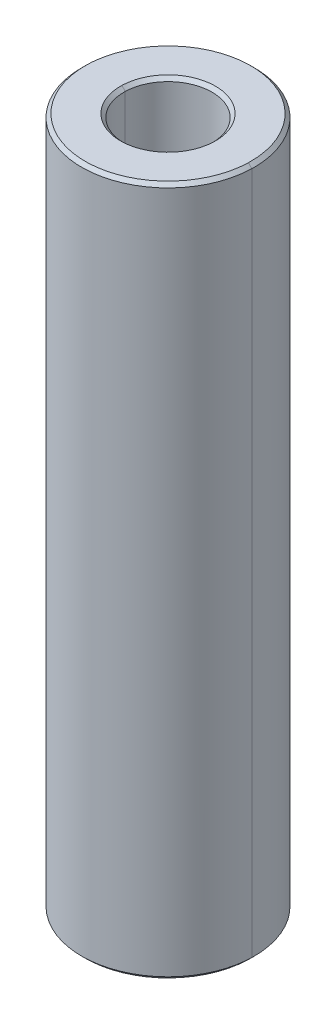
ISO-10303-21;
HEADER;
FILE_DESCRIPTION(('STEP AP214'),'2;1');
FILE_NAME('part.step','',(''),(''),'','','');
FILE_SCHEMA(('AUTOMOTIVE_DESIGN { 1 0 10303 214 1 1 1 1 }'));
ENDSEC;
DATA;
#1=APPLICATION_CONTEXT('core data for automotive mechanical design processes');
#2=APPLICATION_PROTOCOL_DEFINITION('international standard','automotive_design',2000,#1);
#3=PRODUCT_CONTEXT('',#1,'mechanical');
#4=PRODUCT('Part','Part','',(#3));
#5=PRODUCT_RELATED_PRODUCT_CATEGORY('part','',(#4));
#6=PRODUCT_DEFINITION_FORMATION('','',#4);
#7=PRODUCT_DEFINITION_CONTEXT('part definition',#1,'design');
#8=PRODUCT_DEFINITION('design','',#6,#7);
#9=PRODUCT_DEFINITION_SHAPE('','',#8);
#10=(LENGTH_UNIT() NAMED_UNIT(*) SI_UNIT(.MILLI.,.METRE.));
#11=(NAMED_UNIT(*) PLANE_ANGLE_UNIT() SI_UNIT($,.RADIAN.));
#12=(NAMED_UNIT(*) SI_UNIT($,.STERADIAN.) SOLID_ANGLE_UNIT());
#13=UNCERTAINTY_MEASURE_WITH_UNIT(LENGTH_MEASURE(1.E-05),#10,'distance_accuracy_value','');
#14=(GEOMETRIC_REPRESENTATION_CONTEXT(3) GLOBAL_UNCERTAINTY_ASSIGNED_CONTEXT((#13)) GLOBAL_UNIT_ASSIGNED_CONTEXT((#10,
#11,#12)) REPRESENTATION_CONTEXT('',''));
#15=CARTESIAN_POINT('',(0.,0.,0.));
#16=DIRECTION('',(0.,0.,1.));
#17=DIRECTION('',(1.,0.,0.));
#18=AXIS2_PLACEMENT_3D('',#15,#16,#17);
#19=CARTESIAN_POINT('',(45.3533762139517,-108.125917833408,22.3098279325103));
#20=DIRECTION('',(0.,-1.,0.));
#21=DIRECTION('',(0.,0.,-1.));
#22=AXIS2_PLACEMENT_3D('',#19,#20,#21);
#23=PLANE('',#22);
#24=CARTESIAN_POINT('',(54.8158351413591,-108.125917833408,27.3755826686901));
#25=CARTESIAN_POINT('',(54.6820250323687,-108.125917833408,32.173717186889));
#26=CARTESIAN_POINT('',(49.8838905141698,-108.125917833408,32.0399070778986));
#27=CARTESIAN_POINT('',(45.0857559959709,-108.125917833408,31.9060969689082));
#28=CARTESIAN_POINT('',(45.2195661049613,-108.125917833408,27.1079624507092));
#29=(BOUNDED_CURVE() B_SPLINE_CURVE(2,(#24,#25,#26,#27,#28),.UNSPECIFIED.,.F.,
.F.) B_SPLINE_CURVE_WITH_KNOTS((3,2,3),(0.,7.53982236861551,15.079644737231),
.UNSPECIFIED.) CURVE() GEOMETRIC_REPRESENTATION_ITEM() RATIONAL_B_SPLINE_CURVE((1.,
0.707106781186548,1.,0.707106781186548,1.)) REPRESENTATION_ITEM(''));
#30=CARTESIAN_POINT('',(54.8158351413591,-108.125917833408,27.3755826686901));
#31=VERTEX_POINT('',#30);
#32=CARTESIAN_POINT('',(45.2195661049613,-108.125917833408,27.1079624507092));
#33=VERTEX_POINT('',#32);
#34=EDGE_CURVE('E11',#31,#33,#29,.T.);
#35=ORIENTED_EDGE('',*,*,#34,.T.);
#36=CARTESIAN_POINT('',(45.2195661049613,-108.125917833408,27.1079624507092));
#37=CARTESIAN_POINT('',(45.3533762139517,-108.125917833408,22.3098279325103));
#38=CARTESIAN_POINT('',(50.1515107321506,-108.125917833408,22.4436380415007));
#39=CARTESIAN_POINT('',(54.9496452503495,-108.125917833408,22.5774481504911));
#40=CARTESIAN_POINT('',(54.8158351413591,-108.125917833408,27.3755826686901));
#41=(BOUNDED_CURVE() B_SPLINE_CURVE(2,(#36,#37,#38,#39,#40),.UNSPECIFIED.,.F.,
.F.) B_SPLINE_CURVE_WITH_KNOTS((3,2,3),(0.,7.53982236861551,15.079644737231),
.UNSPECIFIED.) CURVE() GEOMETRIC_REPRESENTATION_ITEM() RATIONAL_B_SPLINE_CURVE((1.,
0.707106781186548,1.,0.707106781186548,1.)) REPRESENTATION_ITEM(''));
#42=EDGE_CURVE('E56',#33,#31,#41,.T.);
#43=ORIENTED_EDGE('',*,*,#42,.T.);
#44=EDGE_LOOP('',(#35,#43));
#45=FACE_BOUND('',#44,.T.);
#46=CARTESIAN_POINT('',(52.766631857545,-108.125917833408,27.3184346013087));
#47=CARTESIAN_POINT('',(52.8432938991541,-108.125917833408,24.5695033669239));
#48=CARTESIAN_POINT('',(50.0943626647693,-108.125917833408,24.4928413253149));
#49=CARTESIAN_POINT('',(47.3454314303845,-108.125917833408,24.4161792837058));
#50=CARTESIAN_POINT('',(47.2687693887754,-108.125917833408,27.1651105180906));
#51=(BOUNDED_CURVE() B_SPLINE_CURVE(2,(#46,#47,#48,#49,#50),.UNSPECIFIED.,.F.,
.F.) B_SPLINE_CURVE_WITH_KNOTS((3,2,3),(0.,4.31968989868596,8.63937979737192),
.UNSPECIFIED.) CURVE() GEOMETRIC_REPRESENTATION_ITEM() RATIONAL_B_SPLINE_CURVE((1.,
0.707106781186548,1.,0.707106781186548,1.)) REPRESENTATION_ITEM(''));
#52=CARTESIAN_POINT('',(52.766631857545,-108.125917833408,27.3184346013087));
#53=VERTEX_POINT('',#52);
#54=CARTESIAN_POINT('',(47.2687693887754,-108.125917833408,27.1651105180906));
#55=VERTEX_POINT('',#54);
#56=EDGE_CURVE('E114',#53,#55,#51,.T.);
#57=ORIENTED_EDGE('',*,*,#56,.T.);
#58=CARTESIAN_POINT('',(47.2687693887754,-108.125917833408,27.1651105180906));
#59=CARTESIAN_POINT('',(47.1921073471663,-108.125917833408,29.9140417524754));
#60=CARTESIAN_POINT('',(49.9410385815511,-108.125917833408,29.9907037940844));
#61=CARTESIAN_POINT('',(52.6899698159359,-108.125917833408,30.0673658356935));
#62=CARTESIAN_POINT('',(52.766631857545,-108.125917833408,27.3184346013087));
#63=(BOUNDED_CURVE() B_SPLINE_CURVE(2,(#58,#59,#60,#61,#62),.UNSPECIFIED.,.F.,
.F.) B_SPLINE_CURVE_WITH_KNOTS((3,2,3),(0.,4.31968989868596,8.63937979737192),
.UNSPECIFIED.) CURVE() GEOMETRIC_REPRESENTATION_ITEM() RATIONAL_B_SPLINE_CURVE((1.,
0.707106781186548,1.,0.707106781186548,1.)) REPRESENTATION_ITEM(''));
#64=EDGE_CURVE('E249',#55,#53,#63,.T.);
#65=ORIENTED_EDGE('',*,*,#64,.T.);
#66=EDGE_LOOP('',(#57,#65));
#67=FACE_BOUND('',#66,.T.);
#68=ADVANCED_FACE('F42',(#45,#67),#23,.T.);
#69=CARTESIAN_POINT('',(45.3533762139517,-68.1259178334085,22.3098279325103));
#70=DIRECTION('',(0.,1.,0.));
#71=DIRECTION('',(1.,0.,0.));
#72=AXIS2_PLACEMENT_3D('',#69,#70,#71);
#73=PLANE('',#72);
#74=CARTESIAN_POINT('',(54.8158351413591,-68.1259178334085,27.3755826686901));
#75=CARTESIAN_POINT('',(54.9496452503495,-68.1259178334085,22.5774481504911));
#76=CARTESIAN_POINT('',(50.1515107321506,-68.1259178334085,22.4436380415007));
#77=CARTESIAN_POINT('',(45.3533762139517,-68.1259178334085,22.3098279325103));
#78=CARTESIAN_POINT('',(45.2195661049613,-68.1259178334085,27.1079624507092));
#79=(BOUNDED_CURVE() B_SPLINE_CURVE(2,(#74,#75,#76,#77,#78),.UNSPECIFIED.,.F.,
.F.) B_SPLINE_CURVE_WITH_KNOTS((3,2,3),(0.,7.53982236861549,15.079644737231),
.UNSPECIFIED.) CURVE() GEOMETRIC_REPRESENTATION_ITEM() RATIONAL_B_SPLINE_CURVE((1.,
0.707106781186548,1.,0.707106781186548,1.)) REPRESENTATION_ITEM(''));
#80=CARTESIAN_POINT('',(54.8158351413591,-68.1259178334085,27.3755826686901));
#81=VERTEX_POINT('',#80);
#82=CARTESIAN_POINT('',(45.2195661049613,-68.1259178334085,27.1079624507092));
#83=VERTEX_POINT('',#82);
#84=EDGE_CURVE('E241',#81,#83,#79,.T.);
#85=ORIENTED_EDGE('',*,*,#84,.T.);
#86=CARTESIAN_POINT('',(45.2195661049613,-68.1259178334085,27.1079624507092));
#87=CARTESIAN_POINT('',(45.0857559959709,-68.1259178334085,31.9060969689082));
#88=CARTESIAN_POINT('',(49.8838905141698,-68.1259178334085,32.0399070778986));
#89=CARTESIAN_POINT('',(54.6820250323687,-68.1259178334085,32.173717186889));
#90=CARTESIAN_POINT('',(54.8158351413591,-68.1259178334085,27.3755826686901));
#91=(BOUNDED_CURVE() B_SPLINE_CURVE(2,(#86,#87,#88,#89,#90),.UNSPECIFIED.,.F.,
.F.) B_SPLINE_CURVE_WITH_KNOTS((3,2,3),(0.,7.53982236861549,15.079644737231),
.UNSPECIFIED.) CURVE() GEOMETRIC_REPRESENTATION_ITEM() RATIONAL_B_SPLINE_CURVE((1.,
0.707106781186548,1.,0.707106781186548,1.)) REPRESENTATION_ITEM(''));
#92=EDGE_CURVE('E162',#83,#81,#91,.T.);
#93=ORIENTED_EDGE('',*,*,#92,.T.);
#94=EDGE_LOOP('',(#85,#93));
#95=FACE_BOUND('',#94,.T.);
#96=CARTESIAN_POINT('',(52.766631857545,-68.1259178334085,27.3184346013087));
#97=CARTESIAN_POINT('',(52.6899698159359,-68.1259178334085,30.0673658356935));
#98=CARTESIAN_POINT('',(49.9410385815511,-68.1259178334085,29.9907037940844));
#99=CARTESIAN_POINT('',(47.1921073471663,-68.1259178334085,29.9140417524754));
#100=CARTESIAN_POINT('',(47.2687693887754,-68.1259178334085,27.1651105180906));
#101=(BOUNDED_CURVE() B_SPLINE_CURVE(2,(#96,#97,#98,#99,#100),.UNSPECIFIED.,.F.,
.F.) B_SPLINE_CURVE_WITH_KNOTS((3,2,3),(0.,4.31968989868596,8.63937979737192),
.UNSPECIFIED.) CURVE() GEOMETRIC_REPRESENTATION_ITEM() RATIONAL_B_SPLINE_CURVE((1.,
0.707106781186548,1.,0.707106781186548,1.)) REPRESENTATION_ITEM(''));
#102=CARTESIAN_POINT('',(52.766631857545,-68.1259178334085,27.3184346013087));
#103=VERTEX_POINT('',#102);
#104=CARTESIAN_POINT('',(47.2687693887754,-68.1259178334085,27.1651105180906));
#105=VERTEX_POINT('',#104);
#106=EDGE_CURVE('E154',#103,#105,#101,.T.);
#107=ORIENTED_EDGE('',*,*,#106,.T.);
#108=CARTESIAN_POINT('',(47.2687693887754,-68.1259178334085,27.1651105180906));
#109=CARTESIAN_POINT('',(47.3454314303845,-68.1259178334085,24.4161792837058));
#110=CARTESIAN_POINT('',(50.0943626647693,-68.1259178334085,24.4928413253149));
#111=CARTESIAN_POINT('',(52.8432938991541,-68.1259178334085,24.5695033669239));
#112=CARTESIAN_POINT('',(52.766631857545,-68.1259178334085,27.3184346013087));
#113=(BOUNDED_CURVE() B_SPLINE_CURVE(2,(#108,#109,#110,#111,#112),.UNSPECIFIED.,.F.,
.F.) B_SPLINE_CURVE_WITH_KNOTS((3,2,3),(0.,4.31968989868596,8.63937979737192),
.UNSPECIFIED.) CURVE() GEOMETRIC_REPRESENTATION_ITEM() RATIONAL_B_SPLINE_CURVE((1.,
0.707106781186548,1.,0.707106781186548,1.)) REPRESENTATION_ITEM(''));
#114=EDGE_CURVE('E163',#105,#103,#113,.T.);
#115=ORIENTED_EDGE('',*,*,#114,.T.);
#116=EDGE_LOOP('',(#107,#115));
#117=FACE_BOUND('',#116,.T.);
#118=ADVANCED_FACE('F348',(#95,#117),#73,.T.);
#119=CARTESIAN_POINT('',(55.0157574129507,-107.925917833408,27.381158089898));
#120=CARTESIAN_POINT('',(55.0157574129507,-68.3259178334085,27.381158089898));
#121=CARTESIAN_POINT('',(55.1551429431491,-107.925917833408,22.3831013001075));
#122=CARTESIAN_POINT('',(55.1551429431491,-68.3259178334084,22.3831013001075));
#123=CARTESIAN_POINT('',(50.1570861533586,-107.925917833408,22.2437157699091));
#124=CARTESIAN_POINT('',(50.1570861533586,-68.3259178334085,22.2437157699091));
#125=CARTESIAN_POINT('',(45.159029363568,-107.925917833408,22.1043302397108));
#126=CARTESIAN_POINT('',(45.159029363568,-68.3259178334084,22.1043302397108));
#127=CARTESIAN_POINT('',(45.0196438333697,-107.925917833408,27.1023870295013));
#128=CARTESIAN_POINT('',(45.0196438333697,-68.3259178334085,27.1023870295013));
#129=(BOUNDED_SURFACE() B_SPLINE_SURFACE(2,1,((#119,#120),(#121,#122),(#123,#124),(#125,#126),
(#127,#128)),.UNSPECIFIED.,.F.,.F.,.F.) B_SPLINE_SURFACE_WITH_KNOTS((3,2,3),(2,2),
(1.5707963267949,3.14159265358979,4.71238898038469),(0.199999999999996,39.8),
.UNSPECIFIED.) GEOMETRIC_REPRESENTATION_ITEM() RATIONAL_B_SPLINE_SURFACE(((1.,1.),
(0.707106781186548,0.707106781186548),(1.,1.),(0.707106781186548,0.707106781186548),(1.,1.))) REPRESENTATION_ITEM('') SURFACE());
#130=CARTESIAN_POINT('',(55.0157574129507,-107.925917833408,27.381158089898));
#131=CARTESIAN_POINT('',(55.0157574129507,-68.3259178334085,27.381158089898));
#132=(BOUNDED_CURVE() B_SPLINE_CURVE(1,(#130,#131),.UNSPECIFIED.,.F.,
.F.) B_SPLINE_CURVE_WITH_KNOTS((2,2),(0.,39.6),
.UNSPECIFIED.) CURVE() GEOMETRIC_REPRESENTATION_ITEM() RATIONAL_B_SPLINE_CURVE((1.,1.)) REPRESENTATION_ITEM(''));
#133=CARTESIAN_POINT('',(55.0157574129507,-107.925917833408,27.381158089898));
#134=VERTEX_POINT('',#133);
#135=CARTESIAN_POINT('',(55.0157574129507,-68.3259178334085,27.381158089898));
#136=VERTEX_POINT('',#135);
#137=EDGE_CURVE('E186',#134,#136,#132,.T.);
#138=CARTESIAN_POINT('',(55.0157574129507,-107.925917833408,27.381158089898));
#139=CARTESIAN_POINT('',(55.1551429431491,-107.925917833408,22.3831013001074));
#140=CARTESIAN_POINT('',(50.1570861533585,-107.925917833408,22.2437157699091));
#141=CARTESIAN_POINT('',(45.159029363568,-107.925917833408,22.1043302397108));
#142=CARTESIAN_POINT('',(45.0196438333697,-107.925917833408,27.1023870295013));
#143=(BOUNDED_CURVE() B_SPLINE_CURVE(2,(#138,#139,#140,#141,#142),.UNSPECIFIED.,.F.,
.F.) B_SPLINE_CURVE_WITH_KNOTS((3,2,3),(0.,7.85398163397448,15.707963267949),
.UNSPECIFIED.) CURVE() GEOMETRIC_REPRESENTATION_ITEM() RATIONAL_B_SPLINE_CURVE((1.,
0.707106781186548,1.,0.707106781186548,1.)) REPRESENTATION_ITEM(''));
#144=CARTESIAN_POINT('',(45.0196438333697,-107.925917833408,27.1023870295013));
#145=VERTEX_POINT('',#144);
#146=EDGE_CURVE('E172',#134,#145,#143,.T.);
#147=CARTESIAN_POINT('',(45.0196438333697,-107.925917833408,27.1023870295013));
#148=CARTESIAN_POINT('',(45.0196438333697,-68.3259178334085,27.1023870295013));
#149=(BOUNDED_CURVE() B_SPLINE_CURVE(1,(#147,#148),.UNSPECIFIED.,.F.,
.F.) B_SPLINE_CURVE_WITH_KNOTS((2,2),(0.,39.6),
.UNSPECIFIED.) CURVE() GEOMETRIC_REPRESENTATION_ITEM() RATIONAL_B_SPLINE_CURVE((1.,1.)) REPRESENTATION_ITEM(''));
#150=CARTESIAN_POINT('',(45.0196438333697,-68.3259178334085,27.1023870295013));
#151=VERTEX_POINT('',#150);
#152=EDGE_CURVE('E164',#145,#151,#149,.T.);
#153=CARTESIAN_POINT('',(45.0196438333697,-68.3259178334085,27.1023870295013));
#154=CARTESIAN_POINT('',(45.159029363568,-68.3259178334084,22.1043302397108));
#155=CARTESIAN_POINT('',(50.1570861533585,-68.3259178334085,22.2437157699091));
#156=CARTESIAN_POINT('',(55.1551429431491,-68.3259178334084,22.3831013001074));
#157=CARTESIAN_POINT('',(55.0157574129507,-68.3259178334085,27.381158089898));
#158=(BOUNDED_CURVE() B_SPLINE_CURVE(2,(#153,#154,#155,#156,#157),.UNSPECIFIED.,.F.,
.F.) B_SPLINE_CURVE_WITH_KNOTS((3,2,3),(0.,7.85398163397448,15.707963267949),
.UNSPECIFIED.) CURVE() GEOMETRIC_REPRESENTATION_ITEM() RATIONAL_B_SPLINE_CURVE((1.,
0.707106781186548,1.,0.707106781186548,1.)) REPRESENTATION_ITEM(''));
#159=EDGE_CURVE('E137',#151,#136,#158,.T.);
#160=ORIENTED_EDGE('',*,*,#137,.F.);
#161=ORIENTED_EDGE('',*,*,#146,.T.);
#162=ORIENTED_EDGE('',*,*,#152,.T.);
#163=ORIENTED_EDGE('',*,*,#159,.T.);
#164=EDGE_LOOP('',(#160,#161,#162,#163));
#165=FACE_BOUND('',#164,.T.);
#166=ADVANCED_FACE('F339',(#165),#129,.T.);
#167=CARTESIAN_POINT('',(52.5667095859534,-107.925917833409,27.3128591801008));
#168=CARTESIAN_POINT('',(52.6377962063545,-107.925917833409,24.7638502173076));
#169=CARTESIAN_POINT('',(50.0887872435614,-107.925917833409,24.6927635969065));
#170=CARTESIAN_POINT('',(47.5397782807682,-107.925917833409,24.6216769765053));
#171=CARTESIAN_POINT('',(47.468691660367,-107.925917833409,27.1706859392985));
#172=CARTESIAN_POINT('',(52.5667095859534,-68.3259178334085,27.3128591801008));
#173=CARTESIAN_POINT('',(52.6377962063545,-68.3259178334084,24.7638502173076));
#174=CARTESIAN_POINT('',(50.0887872435614,-68.3259178334085,24.6927635969065));
#175=CARTESIAN_POINT('',(47.5397782807682,-68.3259178334084,24.6216769765053));
#176=CARTESIAN_POINT('',(47.468691660367,-68.3259178334085,27.1706859392985));
#177=(BOUNDED_SURFACE() B_SPLINE_SURFACE(1,2,((#167,#168,#169,#170,#171),(#172,#173,#174,#175,
#176)),.UNSPECIFIED.,.F.,.F.,.F.) B_SPLINE_SURFACE_WITH_KNOTS((2,2),(3,2,3),(0.199999999999974,
39.8),(1.5707963267949,3.14159265358979,4.71238898038469),
.UNSPECIFIED.) GEOMETRIC_REPRESENTATION_ITEM() RATIONAL_B_SPLINE_SURFACE(((1.,0.707106781186548,
1.,0.707106781186548,1.),(1.,0.707106781186548,1.,0.707106781186548,1.))) REPRESENTATION_ITEM('') SURFACE());
#178=CARTESIAN_POINT('',(52.5667095859534,-107.925917833409,27.3128591801008));
#179=CARTESIAN_POINT('',(52.5667095859534,-68.3259178334085,27.3128591801008));
#180=(BOUNDED_CURVE() B_SPLINE_CURVE(1,(#178,#179),.UNSPECIFIED.,.F.,
.F.) B_SPLINE_CURVE_WITH_KNOTS((2,2),(0.,39.6),
.UNSPECIFIED.) CURVE() GEOMETRIC_REPRESENTATION_ITEM() RATIONAL_B_SPLINE_CURVE((1.,1.)) REPRESENTATION_ITEM(''));
#181=CARTESIAN_POINT('',(52.5667095859534,-107.925917833409,27.3128591801008));
#182=VERTEX_POINT('',#181);
#183=CARTESIAN_POINT('',(52.5667095859534,-68.3259178334085,27.3128591801008));
#184=VERTEX_POINT('',#183);
#185=EDGE_CURVE('E125',#182,#184,#180,.T.);
#186=CARTESIAN_POINT('',(52.5667095859534,-68.3259178334085,27.3128591801008));
#187=CARTESIAN_POINT('',(52.6377962063545,-68.3259178334085,24.7638502173076));
#188=CARTESIAN_POINT('',(50.0887872435614,-68.3259178334085,24.6927635969065));
#189=CARTESIAN_POINT('',(47.5397782807682,-68.3259178334085,24.6216769765053));
#190=CARTESIAN_POINT('',(47.468691660367,-68.3259178334085,27.1706859392985));
#191=(BOUNDED_CURVE() B_SPLINE_CURVE(2,(#186,#187,#188,#189,#190),.UNSPECIFIED.,.F.,
.F.) B_SPLINE_CURVE_WITH_KNOTS((3,2,3),(0.,4.00553063332698,8.01106126665396),
.UNSPECIFIED.) CURVE() GEOMETRIC_REPRESENTATION_ITEM() RATIONAL_B_SPLINE_CURVE((1.,
0.707106781186549,1.,0.707106781186549,1.)) REPRESENTATION_ITEM(''));
#192=CARTESIAN_POINT('',(47.468691660367,-68.3259178334085,27.1706859392985));
#193=VERTEX_POINT('',#192);
#194=EDGE_CURVE('E130',#184,#193,#191,.T.);
#195=CARTESIAN_POINT('',(47.468691660367,-107.925917833409,27.1706859392985));
#196=CARTESIAN_POINT('',(47.468691660367,-68.3259178334085,27.1706859392985));
#197=(BOUNDED_CURVE() B_SPLINE_CURVE(1,(#195,#196),.UNSPECIFIED.,.F.,
.F.) B_SPLINE_CURVE_WITH_KNOTS((2,2),(0.,39.6),
.UNSPECIFIED.) CURVE() GEOMETRIC_REPRESENTATION_ITEM() RATIONAL_B_SPLINE_CURVE((1.,1.)) REPRESENTATION_ITEM(''));
#198=CARTESIAN_POINT('',(47.468691660367,-107.925917833409,27.1706859392985));
#199=VERTEX_POINT('',#198);
#200=EDGE_CURVE('E128',#199,#193,#197,.T.);
#201=CARTESIAN_POINT('',(47.468691660367,-107.925917833409,27.1706859392985));
#202=CARTESIAN_POINT('',(47.5397782807682,-107.925917833409,24.6216769765053));
#203=CARTESIAN_POINT('',(50.0887872435614,-107.925917833409,24.6927635969065));
#204=CARTESIAN_POINT('',(52.6377962063545,-107.925917833409,24.7638502173076));
#205=CARTESIAN_POINT('',(52.5667095859534,-107.925917833409,27.3128591801008));
#206=(BOUNDED_CURVE() B_SPLINE_CURVE(2,(#201,#202,#203,#204,#205),.UNSPECIFIED.,.F.,
.F.) B_SPLINE_CURVE_WITH_KNOTS((3,2,3),(0.,4.00553063332698,8.01106126665397),
.UNSPECIFIED.) CURVE() GEOMETRIC_REPRESENTATION_ITEM() RATIONAL_B_SPLINE_CURVE((1.,
0.707106781186548,1.,0.707106781186548,1.)) REPRESENTATION_ITEM(''));
#207=EDGE_CURVE('E111',#199,#182,#206,.T.);
#208=ORIENTED_EDGE('',*,*,#185,.T.);
#209=ORIENTED_EDGE('',*,*,#194,.T.);
#210=ORIENTED_EDGE('',*,*,#200,.F.);
#211=ORIENTED_EDGE('',*,*,#207,.T.);
#212=EDGE_LOOP('',(#208,#209,#210,#211));
#213=FACE_BOUND('',#212,.T.);
#214=ADVANCED_FACE('F123',(#213),#177,.T.);
#215=CARTESIAN_POINT('',(45.2195661049613,-68.1259178334085,27.1079624507093));
#216=CARTESIAN_POINT('',(45.0196438333697,-68.3259178334085,27.1023870295014));
#217=CARTESIAN_POINT('',(45.3533762139516,-68.1259178334086,22.3098279325103));
#218=CARTESIAN_POINT('',(45.1590293635679,-68.3259178334086,22.1043302397108));
#219=CARTESIAN_POINT('',(50.1515107321506,-68.1259178334085,22.4436380415007));
#220=CARTESIAN_POINT('',(50.1570861533585,-68.3259178334085,22.2437157699091));
#221=CARTESIAN_POINT('',(54.9496452503496,-68.1259178334086,22.5774481504911));
#222=CARTESIAN_POINT('',(55.1551429431492,-68.3259178334086,22.3831013001075));
#223=CARTESIAN_POINT('',(54.8158351413591,-68.1259178334085,27.3755826686901));
#224=CARTESIAN_POINT('',(55.0157574129507,-68.3259178334085,27.3811580898981));
#225=(BOUNDED_SURFACE() B_SPLINE_SURFACE(2,1,((#215,#216),(#217,#218),(#219,#220),(#221,#222),
(#223,#224)),.UNSPECIFIED.,.F.,.F.,.F.) B_SPLINE_SURFACE_WITH_KNOTS((3,2,3),(2,2),
(1.57079632679488,3.14159265358979,4.71238898038471),(-0.282842712474626,0.),
.UNSPECIFIED.) GEOMETRIC_REPRESENTATION_ITEM() RATIONAL_B_SPLINE_SURFACE(((1.,1.),
(0.707106781186541,0.707106781186541),(1.,1.),(0.707106781186541,0.707106781186541),(1.,1.))) REPRESENTATION_ITEM('') SURFACE());
#226=CARTESIAN_POINT('',(45.2195661049613,-68.1259178334085,27.1079624507092));
#227=CARTESIAN_POINT('',(45.0196438333697,-68.3259178334085,27.1023870295013));
#228=(BOUNDED_CURVE() B_SPLINE_CURVE(1,(#226,#227),.UNSPECIFIED.,.F.,
.F.) B_SPLINE_CURVE_WITH_KNOTS((2,2),(0.,0.282842712474623),
.UNSPECIFIED.) CURVE() GEOMETRIC_REPRESENTATION_ITEM() RATIONAL_B_SPLINE_CURVE((1.,1.)) REPRESENTATION_ITEM(''));
#229=EDGE_CURVE('E91',#83,#151,#228,.T.);
#230=CARTESIAN_POINT('',(54.8158351413591,-68.1259178334085,27.3755826686901));
#231=CARTESIAN_POINT('',(55.0157574129507,-68.3259178334085,27.381158089898));
#232=(BOUNDED_CURVE() B_SPLINE_CURVE(1,(#230,#231),.UNSPECIFIED.,.F.,
.F.) B_SPLINE_CURVE_WITH_KNOTS((2,2),(0.,0.282842712474623),
.UNSPECIFIED.) CURVE() GEOMETRIC_REPRESENTATION_ITEM() RATIONAL_B_SPLINE_CURVE((1.,1.)) REPRESENTATION_ITEM(''));
#233=EDGE_CURVE('E131',#81,#136,#232,.T.);
#234=ORIENTED_EDGE('',*,*,#229,.F.);
#235=ORIENTED_EDGE('',*,*,#84,.F.);
#236=ORIENTED_EDGE('',*,*,#233,.T.);
#237=ORIENTED_EDGE('',*,*,#159,.F.);
#238=EDGE_LOOP('',(#234,#235,#236,#237));
#239=FACE_BOUND('',#238,.T.);
#240=ADVANCED_FACE('F347',(#239),#225,.T.);
#241=CARTESIAN_POINT('',(52.5667095859534,-68.3259178334085,27.3128591801008));
#242=CARTESIAN_POINT('',(52.6377962063546,-68.3259178334086,24.7638502173076));
#243=CARTESIAN_POINT('',(50.0887872435614,-68.3259178334085,24.6927635969065));
#244=CARTESIAN_POINT('',(47.5397782807682,-68.3259178334086,24.6216769765053));
#245=CARTESIAN_POINT('',(47.468691660367,-68.3259178334085,27.1706859392985));
#246=CARTESIAN_POINT('',(52.766631857545,-68.1259178334085,27.3184346013088));
#247=CARTESIAN_POINT('',(52.8432938991541,-68.1259178334086,24.5695033669239));
#248=CARTESIAN_POINT('',(50.0943626647693,-68.1259178334085,24.4928413253149));
#249=CARTESIAN_POINT('',(47.3454314303845,-68.1259178334086,24.4161792837058));
#250=CARTESIAN_POINT('',(47.2687693887754,-68.1259178334085,27.1651105180906));
#251=(BOUNDED_SURFACE() B_SPLINE_SURFACE(1,2,((#241,#242,#243,#244,#245),(#246,#247,#248,#249,
#250)),.UNSPECIFIED.,.F.,.F.,.F.) B_SPLINE_SURFACE_WITH_KNOTS((2,2),(3,2,3),(-0.282842712474616,
0.),(1.57079632679489,3.14159265358979,4.7123889803847),
.UNSPECIFIED.) GEOMETRIC_REPRESENTATION_ITEM() RATIONAL_B_SPLINE_SURFACE(((1.,0.707106781186544,
1.,0.707106781186544,1.),(1.,0.707106781186544,1.,0.707106781186544,1.))) REPRESENTATION_ITEM('') SURFACE());
#252=CARTESIAN_POINT('',(52.5667095859534,-68.3259178334085,27.3128591801008));
#253=CARTESIAN_POINT('',(52.766631857545,-68.1259178334085,27.3184346013087));
#254=(BOUNDED_CURVE() B_SPLINE_CURVE(1,(#252,#253),.UNSPECIFIED.,.F.,
.F.) B_SPLINE_CURVE_WITH_KNOTS((2,2),(0.,0.282842712474618),
.UNSPECIFIED.) CURVE() GEOMETRIC_REPRESENTATION_ITEM() RATIONAL_B_SPLINE_CURVE((1.,1.)) REPRESENTATION_ITEM(''));
#255=EDGE_CURVE('E192',#184,#103,#254,.T.);
#256=CARTESIAN_POINT('',(47.468691660367,-68.3259178334085,27.1706859392985));
#257=CARTESIAN_POINT('',(47.2687693887754,-68.1259178334085,27.1651105180906));
#258=(BOUNDED_CURVE() B_SPLINE_CURVE(1,(#256,#257),.UNSPECIFIED.,.F.,
.F.) B_SPLINE_CURVE_WITH_KNOTS((2,2),(0.,0.282842712474608),
.UNSPECIFIED.) CURVE() GEOMETRIC_REPRESENTATION_ITEM() RATIONAL_B_SPLINE_CURVE((1.,1.)) REPRESENTATION_ITEM(''));
#259=EDGE_CURVE('E117',#193,#105,#258,.T.);
#260=ORIENTED_EDGE('',*,*,#255,.T.);
#261=ORIENTED_EDGE('',*,*,#114,.F.);
#262=ORIENTED_EDGE('',*,*,#259,.F.);
#263=ORIENTED_EDGE('',*,*,#194,.F.);
#264=EDGE_LOOP('',(#260,#261,#262,#263));
#265=FACE_BOUND('',#264,.T.);
#266=ADVANCED_FACE('F44',(#265),#251,.T.);
#267=CARTESIAN_POINT('',(47.468691660367,-107.925917833409,27.1706859392985));
#268=CARTESIAN_POINT('',(47.5397782807681,-107.925917833409,24.6216769765053));
#269=CARTESIAN_POINT('',(50.0887872435614,-107.925917833409,24.6927635969065));
#270=CARTESIAN_POINT('',(52.6377962063546,-107.925917833409,24.7638502173076));
#271=CARTESIAN_POINT('',(52.5667095859534,-107.925917833409,27.3128591801008));
#272=CARTESIAN_POINT('',(47.2687693887754,-108.125917833408,27.1651105180906));
#273=CARTESIAN_POINT('',(47.3454314303845,-108.125917833408,24.4161792837058));
#274=CARTESIAN_POINT('',(50.0943626647693,-108.125917833408,24.4928413253149));
#275=CARTESIAN_POINT('',(52.8432938991541,-108.125917833408,24.569503366924));
#276=CARTESIAN_POINT('',(52.766631857545,-108.125917833408,27.3184346013088));
#277=(BOUNDED_SURFACE() B_SPLINE_SURFACE(1,2,((#267,#268,#269,#270,#271),(#272,#273,#274,#275,
#276)),.UNSPECIFIED.,.F.,.F.,.F.) B_SPLINE_SURFACE_WITH_KNOTS((2,2),(3,2,3),(0.,
0.282842712474608),(1.57079632679488,3.14159265358979,4.71238898038471),
.UNSPECIFIED.) GEOMETRIC_REPRESENTATION_ITEM() RATIONAL_B_SPLINE_SURFACE(((1.,0.707106781186541,
1.,0.707106781186541,1.),(1.,0.707106781186541,1.,0.707106781186541,1.))) REPRESENTATION_ITEM('') SURFACE());
#278=CARTESIAN_POINT('',(47.468691660367,-107.925917833409,27.1706859392985));
#279=CARTESIAN_POINT('',(47.2687693887754,-108.125917833408,27.1651105180906));
#280=(BOUNDED_CURVE() B_SPLINE_CURVE(1,(#278,#279),.UNSPECIFIED.,.F.,
.F.) B_SPLINE_CURVE_WITH_KNOTS((2,2),(0.,0.282842712474608),
.UNSPECIFIED.) CURVE() GEOMETRIC_REPRESENTATION_ITEM() RATIONAL_B_SPLINE_CURVE((1.,1.)) REPRESENTATION_ITEM(''));
#281=EDGE_CURVE('E140',#199,#55,#280,.T.);
#282=CARTESIAN_POINT('',(52.5667095859534,-107.925917833409,27.3128591801008));
#283=CARTESIAN_POINT('',(52.766631857545,-108.125917833408,27.3184346013087));
#284=(BOUNDED_CURVE() B_SPLINE_CURVE(1,(#282,#283),.UNSPECIFIED.,.F.,
.F.) B_SPLINE_CURVE_WITH_KNOTS((2,2),(0.,0.282842712474608),
.UNSPECIFIED.) CURVE() GEOMETRIC_REPRESENTATION_ITEM() RATIONAL_B_SPLINE_CURVE((1.,1.)) REPRESENTATION_ITEM(''));
#285=EDGE_CURVE('E107',#182,#53,#284,.T.);
#286=ORIENTED_EDGE('',*,*,#281,.T.);
#287=ORIENTED_EDGE('',*,*,#56,.F.);
#288=ORIENTED_EDGE('',*,*,#285,.F.);
#289=ORIENTED_EDGE('',*,*,#207,.F.);
#290=EDGE_LOOP('',(#286,#287,#288,#289));
#291=FACE_BOUND('',#290,.T.);
#292=ADVANCED_FACE('F110',(#291),#277,.T.);
#293=CARTESIAN_POINT('',(54.8158351413591,-108.125917833408,27.3755826686901));
#294=CARTESIAN_POINT('',(55.0157574129507,-107.925917833408,27.381158089898));
#295=CARTESIAN_POINT('',(54.9496452503496,-108.125917833408,22.5774481504911));
#296=CARTESIAN_POINT('',(55.1551429431491,-107.925917833408,22.3831013001075));
#297=CARTESIAN_POINT('',(50.1515107321506,-108.125917833408,22.4436380415007));
#298=CARTESIAN_POINT('',(50.1570861533586,-107.925917833408,22.2437157699091));
#299=CARTESIAN_POINT('',(45.3533762139517,-108.125917833408,22.3098279325103));
#300=CARTESIAN_POINT('',(45.159029363568,-107.925917833408,22.1043302397108));
#301=CARTESIAN_POINT('',(45.2195661049613,-108.125917833408,27.1079624507093));
#302=CARTESIAN_POINT('',(45.0196438333697,-107.925917833408,27.1023870295013));
#303=(BOUNDED_SURFACE() B_SPLINE_SURFACE(2,1,((#293,#294),(#295,#296),(#297,#298),(#299,#300),
(#301,#302)),.UNSPECIFIED.,.F.,.F.,.F.) B_SPLINE_SURFACE_WITH_KNOTS((3,2,3),(2,2),
(1.57079632679489,3.14159265358979,4.7123889803847),(0.,0.282842712474615),
.UNSPECIFIED.) GEOMETRIC_REPRESENTATION_ITEM() RATIONAL_B_SPLINE_SURFACE(((1.,1.),
(0.707106781186544,0.707106781186544),(1.,1.),(0.707106781186544,0.707106781186544),(1.,1.))) REPRESENTATION_ITEM('') SURFACE());
#304=CARTESIAN_POINT('',(54.8158351413591,-108.125917833408,27.3755826686901));
#305=CARTESIAN_POINT('',(55.0157574129507,-107.925917833408,27.381158089898));
#306=(BOUNDED_CURVE() B_SPLINE_CURVE(1,(#304,#305),.UNSPECIFIED.,.F.,
.F.) B_SPLINE_CURVE_WITH_KNOTS((2,2),(0.,0.282842712474618),
.UNSPECIFIED.) CURVE() GEOMETRIC_REPRESENTATION_ITEM() RATIONAL_B_SPLINE_CURVE((1.,1.)) REPRESENTATION_ITEM(''));
#307=EDGE_CURVE('E118',#31,#134,#306,.T.);
#308=CARTESIAN_POINT('',(45.2195661049613,-108.125917833408,27.1079624507092));
#309=CARTESIAN_POINT('',(45.0196438333697,-107.925917833408,27.1023870295013));
#310=(BOUNDED_CURVE() B_SPLINE_CURVE(1,(#308,#309),.UNSPECIFIED.,.F.,
.F.) B_SPLINE_CURVE_WITH_KNOTS((2,2),(0.,0.282842712474618),
.UNSPECIFIED.) CURVE() GEOMETRIC_REPRESENTATION_ITEM() RATIONAL_B_SPLINE_CURVE((1.,1.)) REPRESENTATION_ITEM(''));
#311=EDGE_CURVE('E80',#33,#145,#310,.T.);
#312=ORIENTED_EDGE('',*,*,#307,.F.);
#313=ORIENTED_EDGE('',*,*,#42,.F.);
#314=ORIENTED_EDGE('',*,*,#311,.T.);
#315=ORIENTED_EDGE('',*,*,#146,.F.);
#316=EDGE_LOOP('',(#312,#313,#314,#315));
#317=FACE_BOUND('',#316,.T.);
#318=ADVANCED_FACE('F371',(#317),#303,.T.);
#319=CARTESIAN_POINT('',(45.0196438333697,-107.925917833408,27.1023870295013));
#320=CARTESIAN_POINT('',(45.0196438333697,-68.3259178334085,27.1023870295013));
#321=CARTESIAN_POINT('',(44.8802583031713,-107.925917833408,32.1004438192919));
#322=CARTESIAN_POINT('',(44.8802583031713,-68.3259178334084,32.1004438192919));
#323=CARTESIAN_POINT('',(49.8783150929619,-107.925917833408,32.2398293494902));
#324=CARTESIAN_POINT('',(49.8783150929619,-68.3259178334085,32.2398293494902));
#325=CARTESIAN_POINT('',(54.8763718827524,-107.925917833408,32.3792148796885));
#326=CARTESIAN_POINT('',(54.8763718827524,-68.3259178334084,32.3792148796885));
#327=CARTESIAN_POINT('',(55.0157574129507,-107.925917833408,27.381158089898));
#328=CARTESIAN_POINT('',(55.0157574129507,-68.3259178334085,27.381158089898));
#329=(BOUNDED_SURFACE() B_SPLINE_SURFACE(2,1,((#319,#320),(#321,#322),(#323,#324),(#325,#326),
(#327,#328)),.UNSPECIFIED.,.F.,.F.,.F.) B_SPLINE_SURFACE_WITH_KNOTS((3,2,3),(2,2),
(1.5707963267949,3.14159265358979,4.71238898038469),(0.199999999999996,39.8),
.UNSPECIFIED.) GEOMETRIC_REPRESENTATION_ITEM() RATIONAL_B_SPLINE_SURFACE(((1.,1.),
(0.707106781186548,0.707106781186548),(1.,1.),(0.707106781186548,0.707106781186548),(1.,1.))) REPRESENTATION_ITEM('') SURFACE());
#330=CARTESIAN_POINT('',(55.0157574129507,-68.3259178334085,27.381158089898));
#331=CARTESIAN_POINT('',(54.8763718827524,-68.3259178334084,32.3792148796885));
#332=CARTESIAN_POINT('',(49.8783150929619,-68.3259178334085,32.2398293494902));
#333=CARTESIAN_POINT('',(44.8802583031713,-68.3259178334084,32.1004438192919));
#334=CARTESIAN_POINT('',(45.0196438333697,-68.3259178334085,27.1023870295013));
#335=(BOUNDED_CURVE() B_SPLINE_CURVE(2,(#330,#331,#332,#333,#334),.UNSPECIFIED.,.F.,
.F.) B_SPLINE_CURVE_WITH_KNOTS((3,2,3),(0.,7.85398163397448,15.707963267949),
.UNSPECIFIED.) CURVE() GEOMETRIC_REPRESENTATION_ITEM() RATIONAL_B_SPLINE_CURVE((1.,
0.707106781186548,1.,0.707106781186548,1.)) REPRESENTATION_ITEM(''));
#336=EDGE_CURVE('E143',#136,#151,#335,.T.);
#337=CARTESIAN_POINT('',(45.0196438333697,-107.925917833408,27.1023870295013));
#338=CARTESIAN_POINT('',(44.8802583031713,-107.925917833408,32.1004438192919));
#339=CARTESIAN_POINT('',(49.8783150929619,-107.925917833408,32.2398293494902));
#340=CARTESIAN_POINT('',(54.8763718827524,-107.925917833408,32.3792148796885));
#341=CARTESIAN_POINT('',(55.0157574129507,-107.925917833408,27.381158089898));
#342=(BOUNDED_CURVE() B_SPLINE_CURVE(2,(#337,#338,#339,#340,#341),.UNSPECIFIED.,.F.,
.F.) B_SPLINE_CURVE_WITH_KNOTS((3,2,3),(0.,7.85398163397448,15.707963267949),
.UNSPECIFIED.) CURVE() GEOMETRIC_REPRESENTATION_ITEM() RATIONAL_B_SPLINE_CURVE((1.,
0.707106781186548,1.,0.707106781186548,1.)) REPRESENTATION_ITEM(''));
#343=EDGE_CURVE('E141',#145,#134,#342,.T.);
#344=ORIENTED_EDGE('',*,*,#137,.T.);
#345=ORIENTED_EDGE('',*,*,#336,.T.);
#346=ORIENTED_EDGE('',*,*,#152,.F.);
#347=ORIENTED_EDGE('',*,*,#343,.T.);
#348=EDGE_LOOP('',(#344,#345,#346,#347));
#349=FACE_BOUND('',#348,.T.);
#350=ADVANCED_FACE('F344',(#349),#329,.T.);
#351=CARTESIAN_POINT('',(47.468691660367,-107.925917833409,27.1706859392985));
#352=CARTESIAN_POINT('',(47.3976050399659,-107.925917833409,29.7196949020917));
#353=CARTESIAN_POINT('',(49.9466140027591,-107.925917833409,29.7907815224928));
#354=CARTESIAN_POINT('',(52.4956229655522,-107.925917833409,29.861868142894));
#355=CARTESIAN_POINT('',(52.5667095859534,-107.925917833409,27.3128591801008));
#356=CARTESIAN_POINT('',(47.468691660367,-68.3259178334085,27.1706859392985));
#357=CARTESIAN_POINT('',(47.3976050399659,-68.3259178334084,29.7196949020917));
#358=CARTESIAN_POINT('',(49.9466140027591,-68.3259178334085,29.7907815224928));
#359=CARTESIAN_POINT('',(52.4956229655522,-68.3259178334084,29.861868142894));
#360=CARTESIAN_POINT('',(52.5667095859534,-68.3259178334085,27.3128591801008));
#361=(BOUNDED_SURFACE() B_SPLINE_SURFACE(1,2,((#351,#352,#353,#354,#355),(#356,#357,#358,#359,
#360)),.UNSPECIFIED.,.F.,.F.,.F.) B_SPLINE_SURFACE_WITH_KNOTS((2,2),(3,2,3),(0.199999999999974,
39.8),(1.5707963267949,3.14159265358979,4.71238898038469),
.UNSPECIFIED.) GEOMETRIC_REPRESENTATION_ITEM() RATIONAL_B_SPLINE_SURFACE(((1.,0.707106781186548,
1.,0.707106781186548,1.),(1.,0.707106781186548,1.,0.707106781186548,1.))) REPRESENTATION_ITEM('') SURFACE());
#362=CARTESIAN_POINT('',(52.5667095859534,-107.925917833409,27.3128591801008));
#363=CARTESIAN_POINT('',(52.4956229655522,-107.925917833409,29.861868142894));
#364=CARTESIAN_POINT('',(49.9466140027591,-107.925917833409,29.7907815224928));
#365=CARTESIAN_POINT('',(47.3976050399659,-107.925917833409,29.7196949020917));
#366=CARTESIAN_POINT('',(47.468691660367,-107.925917833409,27.1706859392985));
#367=(BOUNDED_CURVE() B_SPLINE_CURVE(2,(#362,#363,#364,#365,#366),.UNSPECIFIED.,.F.,
.F.) B_SPLINE_CURVE_WITH_KNOTS((3,2,3),(0.,4.00553063332698,8.01106126665397),
.UNSPECIFIED.) CURVE() GEOMETRIC_REPRESENTATION_ITEM() RATIONAL_B_SPLINE_CURVE((1.,
0.707106781186548,1.,0.707106781186548,1.)) REPRESENTATION_ITEM(''));
#368=EDGE_CURVE('E48',#182,#199,#367,.T.);
#369=CARTESIAN_POINT('',(47.468691660367,-68.3259178334085,27.1706859392985));
#370=CARTESIAN_POINT('',(47.3976050399659,-68.3259178334085,29.7196949020917));
#371=CARTESIAN_POINT('',(49.946614002759,-68.3259178334085,29.7907815224928));
#372=CARTESIAN_POINT('',(52.4956229655522,-68.3259178334085,29.861868142894));
#373=CARTESIAN_POINT('',(52.5667095859534,-68.3259178334085,27.3128591801008));
#374=(BOUNDED_CURVE() B_SPLINE_CURVE(2,(#369,#370,#371,#372,#373),.UNSPECIFIED.,.F.,
.F.) B_SPLINE_CURVE_WITH_KNOTS((3,2,3),(0.,4.00553063332699,8.01106126665399),
.UNSPECIFIED.) CURVE() GEOMETRIC_REPRESENTATION_ITEM() RATIONAL_B_SPLINE_CURVE((1.,
0.707106781186547,1.,0.707106781186547,1.)) REPRESENTATION_ITEM(''));
#375=EDGE_CURVE('E136',#193,#184,#374,.T.);
#376=ORIENTED_EDGE('',*,*,#185,.F.);
#377=ORIENTED_EDGE('',*,*,#368,.T.);
#378=ORIENTED_EDGE('',*,*,#200,.T.);
#379=ORIENTED_EDGE('',*,*,#375,.T.);
#380=EDGE_LOOP('',(#376,#377,#378,#379));
#381=FACE_BOUND('',#380,.T.);
#382=ADVANCED_FACE('F134',(#381),#361,.T.);
#383=CARTESIAN_POINT('',(54.8158351413591,-68.1259178334085,27.3755826686901));
#384=CARTESIAN_POINT('',(55.0157574129508,-68.3259178334085,27.381158089898));
#385=CARTESIAN_POINT('',(54.6820250323687,-68.1259178334085,32.173717186889));
#386=CARTESIAN_POINT('',(54.8763718827524,-68.3259178334084,32.3792148796885));
#387=CARTESIAN_POINT('',(49.8838905141698,-68.1259178334085,32.0399070778986));
#388=CARTESIAN_POINT('',(49.8783150929619,-68.3259178334085,32.2398293494902));
#389=CARTESIAN_POINT('',(45.0857559959709,-68.1259178334085,31.9060969689082));
#390=CARTESIAN_POINT('',(44.8802583031713,-68.3259178334084,32.1004438192919));
#391=CARTESIAN_POINT('',(45.2195661049613,-68.1259178334085,27.1079624507092));
#392=CARTESIAN_POINT('',(45.0196438333697,-68.3259178334085,27.1023870295013));
#393=(BOUNDED_SURFACE() B_SPLINE_SURFACE(2,1,((#383,#384),(#385,#386),(#387,#388),(#389,#390),
(#391,#392)),.UNSPECIFIED.,.F.,.F.,.F.) B_SPLINE_SURFACE_WITH_KNOTS((3,2,3),(2,2),
(1.5707963267949,3.14159265358979,4.71238898038469),(-0.282842712474626,0.),
.UNSPECIFIED.) GEOMETRIC_REPRESENTATION_ITEM() RATIONAL_B_SPLINE_SURFACE(((1.,1.),
(0.707106781186548,0.707106781186548),(1.,1.),(0.707106781186548,0.707106781186548),(1.,1.))) REPRESENTATION_ITEM('') SURFACE());
#394=ORIENTED_EDGE('',*,*,#229,.T.);
#395=ORIENTED_EDGE('',*,*,#336,.F.);
#396=ORIENTED_EDGE('',*,*,#233,.F.);
#397=ORIENTED_EDGE('',*,*,#92,.F.);
#398=EDGE_LOOP('',(#394,#395,#396,#397));
#399=FACE_BOUND('',#398,.T.);
#400=ADVANCED_FACE('F345',(#399),#393,.T.);
#401=CARTESIAN_POINT('',(47.468691660367,-68.3259178334085,27.1706859392985));
#402=CARTESIAN_POINT('',(47.3976050399658,-68.3259178334086,29.7196949020917));
#403=CARTESIAN_POINT('',(49.9466140027591,-68.3259178334085,29.7907815224928));
#404=CARTESIAN_POINT('',(52.4956229655523,-68.3259178334086,29.861868142894));
#405=CARTESIAN_POINT('',(52.5667095859534,-68.3259178334085,27.3128591801007));
#406=CARTESIAN_POINT('',(47.2687693887754,-68.1259178334085,27.1651105180905));
#407=CARTESIAN_POINT('',(47.1921073471663,-68.1259178334086,29.9140417524754));
#408=CARTESIAN_POINT('',(49.9410385815511,-68.1259178334085,29.9907037940844));
#409=CARTESIAN_POINT('',(52.689969815936,-68.1259178334086,30.0673658356935));
#410=CARTESIAN_POINT('',(52.766631857545,-68.1259178334085,27.3184346013087));
#411=(BOUNDED_SURFACE() B_SPLINE_SURFACE(1,2,((#401,#402,#403,#404,#405),(#406,#407,#408,#409,
#410)),.UNSPECIFIED.,.F.,.F.,.F.) B_SPLINE_SURFACE_WITH_KNOTS((2,2),(3,2,3),(-0.282842712474616,
0.),(1.57079632679488,3.14159265358979,4.71238898038471),
.UNSPECIFIED.) GEOMETRIC_REPRESENTATION_ITEM() RATIONAL_B_SPLINE_SURFACE(((1.,0.707106781186541,
1.,0.707106781186541,1.),(1.,0.707106781186541,1.,0.707106781186541,1.))) REPRESENTATION_ITEM('') SURFACE());
#412=ORIENTED_EDGE('',*,*,#255,.F.);
#413=ORIENTED_EDGE('',*,*,#375,.F.);
#414=ORIENTED_EDGE('',*,*,#259,.T.);
#415=ORIENTED_EDGE('',*,*,#106,.F.);
#416=EDGE_LOOP('',(#412,#413,#414,#415));
#417=FACE_BOUND('',#416,.T.);
#418=ADVANCED_FACE('F294',(#417),#411,.T.);
#419=CARTESIAN_POINT('',(52.5667095859534,-107.925917833409,27.3128591801008));
#420=CARTESIAN_POINT('',(52.4956229655522,-107.925917833409,29.861868142894));
#421=CARTESIAN_POINT('',(49.9466140027591,-107.925917833409,29.7907815224928));
#422=CARTESIAN_POINT('',(47.3976050399659,-107.925917833409,29.7196949020917));
#423=CARTESIAN_POINT('',(47.468691660367,-107.925917833409,27.1706859392985));
#424=CARTESIAN_POINT('',(52.766631857545,-108.125917833408,27.3184346013087));
#425=CARTESIAN_POINT('',(52.6899698159359,-108.125917833408,30.0673658356935));
#426=CARTESIAN_POINT('',(49.9410385815511,-108.125917833408,29.9907037940844));
#427=CARTESIAN_POINT('',(47.1921073471663,-108.125917833408,29.9140417524754));
#428=CARTESIAN_POINT('',(47.2687693887754,-108.125917833408,27.1651105180906));
#429=(BOUNDED_SURFACE() B_SPLINE_SURFACE(1,2,((#419,#420,#421,#422,#423),(#424,#425,#426,#427,
#428)),.UNSPECIFIED.,.F.,.F.,.F.) B_SPLINE_SURFACE_WITH_KNOTS((2,2),(3,2,3),(0.,
0.282842712474608),(1.5707963267949,3.14159265358979,4.71238898038469),
.UNSPECIFIED.) GEOMETRIC_REPRESENTATION_ITEM() RATIONAL_B_SPLINE_SURFACE(((1.,0.707106781186548,
1.,0.707106781186548,1.),(1.,0.707106781186548,1.,0.707106781186548,1.))) REPRESENTATION_ITEM('') SURFACE());
#430=ORIENTED_EDGE('',*,*,#281,.F.);
#431=ORIENTED_EDGE('',*,*,#368,.F.);
#432=ORIENTED_EDGE('',*,*,#285,.T.);
#433=ORIENTED_EDGE('',*,*,#64,.F.);
#434=EDGE_LOOP('',(#430,#431,#432,#433));
#435=FACE_BOUND('',#434,.T.);
#436=ADVANCED_FACE('F139',(#435),#429,.T.);
#437=CARTESIAN_POINT('',(45.2195661049613,-108.125917833408,27.1079624507092));
#438=CARTESIAN_POINT('',(45.0196438333697,-107.925917833408,27.1023870295012));
#439=CARTESIAN_POINT('',(45.0857559959708,-108.125917833408,31.9060969689082));
#440=CARTESIAN_POINT('',(44.8802583031712,-107.925917833408,32.1004438192918));
#441=CARTESIAN_POINT('',(49.8838905141698,-108.125917833408,32.0399070778986));
#442=CARTESIAN_POINT('',(49.8783150929619,-107.925917833408,32.2398293494902));
#443=CARTESIAN_POINT('',(54.6820250323688,-108.125917833408,32.173717186889));
#444=CARTESIAN_POINT('',(54.8763718827525,-107.925917833408,32.3792148796885));
#445=CARTESIAN_POINT('',(54.8158351413591,-108.125917833408,27.37558266869));
#446=CARTESIAN_POINT('',(55.0157574129508,-107.925917833408,27.3811580898979));
#447=(BOUNDED_SURFACE() B_SPLINE_SURFACE(2,1,((#437,#438),(#439,#440),(#441,#442),(#443,#444),
(#445,#446)),.UNSPECIFIED.,.F.,.F.,.F.) B_SPLINE_SURFACE_WITH_KNOTS((3,2,3),(2,2),
(1.57079632679488,3.14159265358979,4.71238898038471),(0.,0.282842712474615),
.UNSPECIFIED.) GEOMETRIC_REPRESENTATION_ITEM() RATIONAL_B_SPLINE_SURFACE(((1.,1.),
(0.707106781186541,0.707106781186541),(1.,1.),(0.707106781186541,0.707106781186541),(1.,1.))) REPRESENTATION_ITEM('') SURFACE());
#448=ORIENTED_EDGE('',*,*,#307,.T.);
#449=ORIENTED_EDGE('',*,*,#343,.F.);
#450=ORIENTED_EDGE('',*,*,#311,.F.);
#451=ORIENTED_EDGE('',*,*,#34,.F.);
#452=EDGE_LOOP('',(#448,#449,#450,#451));
#453=FACE_BOUND('',#452,.T.);
#454=ADVANCED_FACE('F341',(#453),#447,.T.);
#455=CLOSED_SHELL('',(#68,#118,#166,#214,#240,#266,#292,#318,#350,#382,#400,#418,#436,#454));
#456=MANIFOLD_SOLID_BREP('B2',#455);
#457=ADVANCED_BREP_SHAPE_REPRESENTATION('',(#18,#456),#14);
#458=SHAPE_DEFINITION_REPRESENTATION(#9,#457);
ENDSEC;
END-ISO-10303-21;
